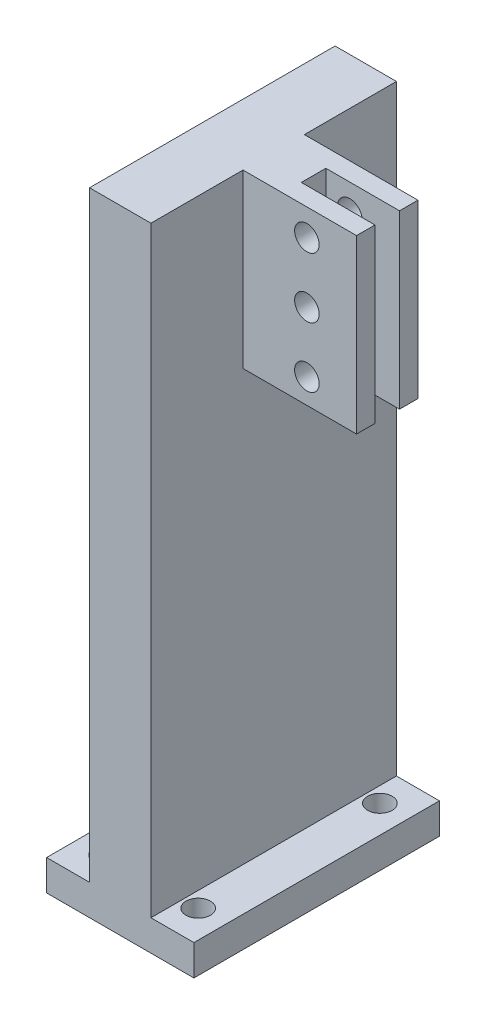
ISO-10303-21;
HEADER;
FILE_DESCRIPTION(('STEP AP214'),'2;1');
FILE_NAME('part.step','',(''),(''),'','','');
FILE_SCHEMA(('AUTOMOTIVE_DESIGN { 1 0 10303 214 1 1 1 1 }'));
ENDSEC;
DATA;
#1=APPLICATION_CONTEXT('core data for automotive mechanical design processes');
#2=APPLICATION_PROTOCOL_DEFINITION('international standard','automotive_design',2000,#1);
#3=PRODUCT_CONTEXT('',#1,'mechanical');
#4=PRODUCT('Part','Part','',(#3));
#5=PRODUCT_RELATED_PRODUCT_CATEGORY('part','',(#4));
#6=PRODUCT_DEFINITION_FORMATION('','',#4);
#7=PRODUCT_DEFINITION_CONTEXT('part definition',#1,'design');
#8=PRODUCT_DEFINITION('design','',#6,#7);
#9=PRODUCT_DEFINITION_SHAPE('','',#8);
#10=(LENGTH_UNIT() NAMED_UNIT(*) SI_UNIT(.MILLI.,.METRE.));
#11=(NAMED_UNIT(*) PLANE_ANGLE_UNIT() SI_UNIT($,.RADIAN.));
#12=(NAMED_UNIT(*) SI_UNIT($,.STERADIAN.) SOLID_ANGLE_UNIT());
#13=UNCERTAINTY_MEASURE_WITH_UNIT(LENGTH_MEASURE(1.E-05),#10,'distance_accuracy_value','');
#14=(GEOMETRIC_REPRESENTATION_CONTEXT(3) GLOBAL_UNCERTAINTY_ASSIGNED_CONTEXT((#13)) GLOBAL_UNIT_ASSIGNED_CONTEXT((#10,
#11,#12)) REPRESENTATION_CONTEXT('',''));
#15=CARTESIAN_POINT('',(0.,0.,0.));
#16=DIRECTION('',(0.,0.,1.));
#17=DIRECTION('',(1.,0.,0.));
#18=AXIS2_PLACEMENT_3D('',#15,#16,#17);
#19=CARTESIAN_POINT('',(0.,103.,0.));
#20=DIRECTION('',(0.,1.,0.));
#21=DIRECTION('',(0.,0.,1.));
#22=AXIS2_PLACEMENT_3D('',#19,#20,#21);
#23=PLANE('',#22);
#24=DIRECTION('',(0.,0.,1.));
#25=VECTOR('',#24,1.);
#26=CARTESIAN_POINT('',(11.5,103.,-2.));
#27=LINE('',#26,#25);
#28=CARTESIAN_POINT('',(11.5,103.,-2.));
#29=VERTEX_POINT('',#28);
#30=CARTESIAN_POINT('',(11.5,103.,2.));
#31=VERTEX_POINT('',#30);
#32=EDGE_CURVE('E176',#29,#31,#27,.T.);
#33=ORIENTED_EDGE('',*,*,#32,.F.);
#34=DIRECTION('',(-1.,0.,0.));
#35=VECTOR('',#34,1.);
#36=CARTESIAN_POINT('',(23.5,103.,-2.));
#37=LINE('',#36,#35);
#38=CARTESIAN_POINT('',(23.5,103.,-2.));
#39=VERTEX_POINT('',#38);
#40=EDGE_CURVE('E163',#39,#29,#37,.T.);
#41=ORIENTED_EDGE('',*,*,#40,.F.);
#42=DIRECTION('',(0.,0.,1.));
#43=VECTOR('',#42,1.);
#44=CARTESIAN_POINT('',(23.5,103.,5.));
#45=LINE('',#44,#43);
#46=CARTESIAN_POINT('',(23.5,103.,-5.));
#47=VERTEX_POINT('',#46);
#48=EDGE_CURVE('E174',#47,#39,#45,.T.);
#49=ORIENTED_EDGE('',*,*,#48,.F.);
#50=DIRECTION('',(-1.,0.,0.));
#51=VECTOR('',#50,1.);
#52=CARTESIAN_POINT('',(23.5,103.,-5.));
#53=LINE('',#52,#51);
#54=CARTESIAN_POINT('',(5.,103.,-5.));
#55=VERTEX_POINT('',#54);
#56=EDGE_CURVE('E217',#47,#55,#53,.T.);
#57=ORIENTED_EDGE('',*,*,#56,.T.);
#58=DIRECTION('',(0.,0.,-1.));
#59=VECTOR('',#58,1.);
#60=CARTESIAN_POINT('',(5.,103.,20.));
#61=LINE('',#60,#59);
#62=CARTESIAN_POINT('',(5.,103.,-20.));
#63=VERTEX_POINT('',#62);
#64=EDGE_CURVE('E225',#55,#63,#61,.T.);
#65=ORIENTED_EDGE('',*,*,#64,.T.);
#66=DIRECTION('',(-1.,0.,0.));
#67=VECTOR('',#66,1.);
#68=CARTESIAN_POINT('',(5.,103.,-20.));
#69=LINE('',#68,#67);
#70=CARTESIAN_POINT('',(-5.,103.,-20.));
#71=VERTEX_POINT('',#70);
#72=EDGE_CURVE('E231',#63,#71,#69,.T.);
#73=ORIENTED_EDGE('',*,*,#72,.T.);
#74=DIRECTION('',(0.,0.,1.));
#75=VECTOR('',#74,1.);
#76=CARTESIAN_POINT('',(-5.,103.,-20.));
#77=LINE('',#76,#75);
#78=CARTESIAN_POINT('',(-5.,103.,20.));
#79=VERTEX_POINT('',#78);
#80=EDGE_CURVE('E234',#71,#79,#77,.T.);
#81=ORIENTED_EDGE('',*,*,#80,.T.);
#82=DIRECTION('',(1.,0.,0.));
#83=VECTOR('',#82,1.);
#84=CARTESIAN_POINT('',(-5.,103.,20.));
#85=LINE('',#84,#83);
#86=CARTESIAN_POINT('',(5.,103.,20.));
#87=VERTEX_POINT('',#86);
#88=EDGE_CURVE('E221',#79,#87,#85,.T.);
#89=ORIENTED_EDGE('',*,*,#88,.T.);
#90=CARTESIAN_POINT('',(5.,103.,5.));
#91=VERTEX_POINT('',#90);
#92=EDGE_CURVE('E227',#87,#91,#61,.T.);
#93=ORIENTED_EDGE('',*,*,#92,.T.);
#94=DIRECTION('',(-1.,0.,0.));
#95=VECTOR('',#94,1.);
#96=CARTESIAN_POINT('',(23.5,103.,5.));
#97=LINE('',#96,#95);
#98=CARTESIAN_POINT('',(23.5,103.,5.));
#99=VERTEX_POINT('',#98);
#100=EDGE_CURVE('E214',#99,#91,#97,.T.);
#101=ORIENTED_EDGE('',*,*,#100,.F.);
#102=CARTESIAN_POINT('',(23.5,103.,2.));
#103=VERTEX_POINT('',#102);
#104=EDGE_CURVE('E185',#103,#99,#45,.T.);
#105=ORIENTED_EDGE('',*,*,#104,.F.);
#106=DIRECTION('',(-1.,0.,0.));
#107=VECTOR('',#106,1.);
#108=CARTESIAN_POINT('',(23.5,103.,2.));
#109=LINE('',#108,#107);
#110=EDGE_CURVE('E57',#103,#31,#109,.T.);
#111=ORIENTED_EDGE('',*,*,#110,.T.);
#112=EDGE_LOOP('',(#33,#41,#49,#57,#65,#73,#81,#89,#93,#101,#105,#111));
#113=FACE_BOUND('',#112,.T.);
#114=ADVANCED_FACE('F39',(#113),#23,.T.);
#115=CARTESIAN_POINT('',(23.5,75.,-5.));
#116=DIRECTION('',(0.,1.,0.));
#117=DIRECTION('',(0.,0.,1.));
#118=AXIS2_PLACEMENT_3D('',#115,#116,#117);
#119=PLANE('',#118);
#120=DIRECTION('',(1.,0.,0.));
#121=VECTOR('',#120,1.);
#122=CARTESIAN_POINT('',(11.5,75.,-2.));
#123=LINE('',#122,#121);
#124=CARTESIAN_POINT('',(11.5,75.,-2.));
#125=VERTEX_POINT('',#124);
#126=CARTESIAN_POINT('',(23.5,75.,-2.));
#127=VERTEX_POINT('',#126);
#128=EDGE_CURVE('E166',#125,#127,#123,.T.);
#129=ORIENTED_EDGE('',*,*,#128,.F.);
#130=DIRECTION('',(0.,0.,1.));
#131=VECTOR('',#130,1.);
#132=CARTESIAN_POINT('',(11.5,75.,-2.));
#133=LINE('',#132,#131);
#134=CARTESIAN_POINT('',(11.5,75.,2.));
#135=VERTEX_POINT('',#134);
#136=EDGE_CURVE('E345',#125,#135,#133,.T.);
#137=ORIENTED_EDGE('',*,*,#136,.T.);
#138=DIRECTION('',(1.,0.,0.));
#139=VECTOR('',#138,1.);
#140=CARTESIAN_POINT('',(11.5,75.,2.));
#141=LINE('',#140,#139);
#142=CARTESIAN_POINT('',(23.5,75.,2.));
#143=VERTEX_POINT('',#142);
#144=EDGE_CURVE('E171',#135,#143,#141,.T.);
#145=ORIENTED_EDGE('',*,*,#144,.T.);
#146=DIRECTION('',(0.,0.,-1.));
#147=VECTOR('',#146,1.);
#148=CARTESIAN_POINT('',(23.5,75.,-5.));
#149=LINE('',#148,#147);
#150=CARTESIAN_POINT('',(23.5,75.,5.));
#151=VERTEX_POINT('',#150);
#152=EDGE_CURVE('E194',#151,#143,#149,.T.);
#153=ORIENTED_EDGE('',*,*,#152,.F.);
#154=DIRECTION('',(-1.,0.,0.));
#155=VECTOR('',#154,1.);
#156=CARTESIAN_POINT('',(23.5,75.,5.));
#157=LINE('',#156,#155);
#158=CARTESIAN_POINT('',(5.,75.,5.));
#159=VERTEX_POINT('',#158);
#160=EDGE_CURVE('E210',#151,#159,#157,.T.);
#161=ORIENTED_EDGE('',*,*,#160,.T.);
#162=DIRECTION('',(0.,0.,-1.));
#163=VECTOR('',#162,1.);
#164=CARTESIAN_POINT('',(5.,75.,-5.));
#165=LINE('',#164,#163);
#166=CARTESIAN_POINT('',(5.,75.,-5.));
#167=VERTEX_POINT('',#166);
#168=EDGE_CURVE('E205',#159,#167,#165,.T.);
#169=ORIENTED_EDGE('',*,*,#168,.T.);
#170=DIRECTION('',(-1.,0.,0.));
#171=VECTOR('',#170,1.);
#172=CARTESIAN_POINT('',(23.5,75.,-5.));
#173=LINE('',#172,#171);
#174=CARTESIAN_POINT('',(23.5,75.,-5.));
#175=VERTEX_POINT('',#174);
#176=EDGE_CURVE('E198',#175,#167,#173,.T.);
#177=ORIENTED_EDGE('',*,*,#176,.F.);
#178=EDGE_CURVE('E189',#127,#175,#149,.T.);
#179=ORIENTED_EDGE('',*,*,#178,.F.);
#180=EDGE_LOOP('',(#129,#137,#145,#153,#161,#169,#177,#179));
#181=FACE_BOUND('',#180,.T.);
#182=ADVANCED_FACE('F407',(#181),#119,.F.);
#183=CARTESIAN_POINT('',(23.5,0.,0.));
#184=DIRECTION('',(-1.,0.,0.));
#185=DIRECTION('',(0.,0.,1.));
#186=AXIS2_PLACEMENT_3D('',#183,#184,#185);
#187=PLANE('',#186);
#188=DIRECTION('',(0.,1.,0.));
#189=VECTOR('',#188,1.);
#190=CARTESIAN_POINT('',(23.5,75.,-2.));
#191=LINE('',#190,#189);
#192=EDGE_CURVE('E158',#127,#39,#191,.T.);
#193=ORIENTED_EDGE('',*,*,#192,.F.);
#194=ORIENTED_EDGE('',*,*,#178,.T.);
#195=DIRECTION('',(0.,1.,0.));
#196=VECTOR('',#195,1.);
#197=CARTESIAN_POINT('',(23.5,103.,-5.));
#198=LINE('',#197,#196);
#199=EDGE_CURVE('E182',#175,#47,#198,.T.);
#200=ORIENTED_EDGE('',*,*,#199,.T.);
#201=ORIENTED_EDGE('',*,*,#48,.T.);
#202=EDGE_LOOP('',(#193,#194,#200,#201));
#203=FACE_BOUND('',#202,.T.);
#204=ADVANCED_FACE('F180',(#203),#187,.F.);
#205=CARTESIAN_POINT('',(15.41,79.03,19.5));
#206=DIRECTION('',(0.,0.,-1.));
#207=DIRECTION('',(0.,1.,0.));
#208=AXIS2_PLACEMENT_3D('',#205,#206,#207);
#209=CYLINDRICAL_SURFACE('',#208,2.);
#210=CARTESIAN_POINT('',(15.41,79.03,-5.));
#211=DIRECTION('',(0.,0.,-1.));
#212=DIRECTION('',(0.,1.,0.));
#213=AXIS2_PLACEMENT_3D('',#210,#211,#212);
#214=CIRCLE('',#213,2.);
#215=CARTESIAN_POINT('',(15.41,81.03,-5.));
#216=VERTEX_POINT('',#215);
#217=EDGE_CURVE('E373',#216,#216,#214,.T.);
#218=ORIENTED_EDGE('',*,*,#217,.T.);
#219=EDGE_LOOP('',(#218));
#220=FACE_BOUND('',#219,.T.);
#221=CARTESIAN_POINT('',(15.41,79.03,-2.));
#222=DIRECTION('',(0.,0.,1.));
#223=DIRECTION('',(1.,0.,0.));
#224=AXIS2_PLACEMENT_3D('',#221,#222,#223);
#225=CIRCLE('',#224,2.);
#226=CARTESIAN_POINT('',(17.41,79.03,-2.));
#227=VERTEX_POINT('',#226);
#228=EDGE_CURVE('E369',#227,#227,#225,.F.);
#229=ORIENTED_EDGE('',*,*,#228,.F.);
#230=EDGE_LOOP('',(#229));
#231=FACE_BOUND('',#230,.T.);
#232=ADVANCED_FACE('F384',(#220,#231),#209,.F.);
#233=CARTESIAN_POINT('',(15.41,88.85,19.5));
#234=DIRECTION('',(0.,0.,-1.));
#235=DIRECTION('',(0.,1.,0.));
#236=AXIS2_PLACEMENT_3D('',#233,#234,#235);
#237=CYLINDRICAL_SURFACE('',#236,2.);
#238=CARTESIAN_POINT('',(15.41,88.85,-5.));
#239=DIRECTION('',(0.,0.,-1.));
#240=DIRECTION('',(0.,1.,0.));
#241=AXIS2_PLACEMENT_3D('',#238,#239,#240);
#242=CIRCLE('',#241,2.);
#243=CARTESIAN_POINT('',(15.41,90.85,-5.));
#244=VERTEX_POINT('',#243);
#245=EDGE_CURVE('E377',#244,#244,#242,.T.);
#246=ORIENTED_EDGE('',*,*,#245,.T.);
#247=EDGE_LOOP('',(#246));
#248=FACE_BOUND('',#247,.T.);
#249=CARTESIAN_POINT('',(15.41,88.85,-2.));
#250=DIRECTION('',(0.,0.,1.));
#251=DIRECTION('',(1.,0.,0.));
#252=AXIS2_PLACEMENT_3D('',#249,#250,#251);
#253=CIRCLE('',#252,2.);
#254=CARTESIAN_POINT('',(17.41,88.85,-2.));
#255=VERTEX_POINT('',#254);
#256=EDGE_CURVE('E365',#255,#255,#253,.F.);
#257=ORIENTED_EDGE('',*,*,#256,.F.);
#258=EDGE_LOOP('',(#257));
#259=FACE_BOUND('',#258,.T.);
#260=ADVANCED_FACE('F528',(#248,#259),#237,.F.);
#261=CARTESIAN_POINT('',(15.41,98.67,19.5));
#262=DIRECTION('',(0.,0.,-1.));
#263=DIRECTION('',(0.,1.,0.));
#264=AXIS2_PLACEMENT_3D('',#261,#262,#263);
#265=CYLINDRICAL_SURFACE('',#264,2.);
#266=CARTESIAN_POINT('',(15.41,98.67,-5.));
#267=DIRECTION('',(0.,0.,-1.));
#268=DIRECTION('',(0.,1.,0.));
#269=AXIS2_PLACEMENT_3D('',#266,#267,#268);
#270=CIRCLE('',#269,2.);
#271=CARTESIAN_POINT('',(15.41,100.67,-5.));
#272=VERTEX_POINT('',#271);
#273=EDGE_CURVE('E335',#272,#272,#270,.T.);
#274=ORIENTED_EDGE('',*,*,#273,.T.);
#275=EDGE_LOOP('',(#274));
#276=FACE_BOUND('',#275,.T.);
#277=CARTESIAN_POINT('',(15.41,98.67,-2.));
#278=DIRECTION('',(0.,0.,1.));
#279=DIRECTION('',(1.,0.,0.));
#280=AXIS2_PLACEMENT_3D('',#277,#278,#279);
#281=CIRCLE('',#280,2.);
#282=CARTESIAN_POINT('',(17.41,98.67,-2.));
#283=VERTEX_POINT('',#282);
#284=EDGE_CURVE('E43',#283,#283,#281,.F.);
#285=ORIENTED_EDGE('',*,*,#284,.F.);
#286=EDGE_LOOP('',(#285));
#287=FACE_BOUND('',#286,.T.);
#288=ADVANCED_FACE('F417',(#276,#287),#265,.F.);
#289=CARTESIAN_POINT('',(5.,103.,20.));
#290=DIRECTION('',(-1.,0.,0.));
#291=DIRECTION('',(0.,0.,1.));
#292=AXIS2_PLACEMENT_3D('',#289,#290,#291);
#293=PLANE('',#292);
#294=DIRECTION('',(0.,1.,0.));
#295=VECTOR('',#294,1.);
#296=CARTESIAN_POINT('',(5.,103.,-5.));
#297=LINE('',#296,#295);
#298=EDGE_CURVE('E65',#167,#55,#297,.T.);
#299=ORIENTED_EDGE('',*,*,#298,.F.);
#300=ORIENTED_EDGE('',*,*,#168,.F.);
#301=DIRECTION('',(0.,-1.,0.));
#302=VECTOR('',#301,1.);
#303=CARTESIAN_POINT('',(5.,75.,5.));
#304=LINE('',#303,#302);
#305=EDGE_CURVE('E201',#91,#159,#304,.T.);
#306=ORIENTED_EDGE('',*,*,#305,.F.);
#307=ORIENTED_EDGE('',*,*,#92,.F.);
#308=DIRECTION('',(0.,-1.,0.));
#309=VECTOR('',#308,1.);
#310=CARTESIAN_POINT('',(5.,103.,20.));
#311=LINE('',#310,#309);
#312=CARTESIAN_POINT('',(5.,5.,20.));
#313=VERTEX_POINT('',#312);
#314=EDGE_CURVE('E255',#87,#313,#311,.T.);
#315=ORIENTED_EDGE('',*,*,#314,.T.);
#316=DIRECTION('',(0.,0.,-1.));
#317=VECTOR('',#316,1.);
#318=CARTESIAN_POINT('',(5.,5.,20.));
#319=LINE('',#318,#317);
#320=CARTESIAN_POINT('',(5.,5.,-20.));
#321=VERTEX_POINT('',#320);
#322=EDGE_CURVE('E220',#313,#321,#319,.T.);
#323=ORIENTED_EDGE('',*,*,#322,.T.);
#324=DIRECTION('',(0.,-1.,0.));
#325=VECTOR('',#324,1.);
#326=CARTESIAN_POINT('',(5.,103.,-20.));
#327=LINE('',#326,#325);
#328=EDGE_CURVE('E251',#63,#321,#327,.T.);
#329=ORIENTED_EDGE('',*,*,#328,.F.);
#330=ORIENTED_EDGE('',*,*,#64,.F.);
#331=EDGE_LOOP('',(#299,#300,#306,#307,#315,#323,#329,#330));
#332=FACE_BOUND('',#331,.T.);
#333=ADVANCED_FACE('F413',(#332),#293,.F.);
#334=CARTESIAN_POINT('',(0.,5.,0.));
#335=DIRECTION('',(0.,1.,0.));
#336=DIRECTION('',(0.,0.,1.));
#337=AXIS2_PLACEMENT_3D('',#334,#335,#336);
#338=PLANE('',#337);
#339=DIRECTION('',(0.,0.,1.));
#340=VECTOR('',#339,1.);
#341=CARTESIAN_POINT('',(-5.,5.,0.));
#342=LINE('',#341,#340);
#343=CARTESIAN_POINT('',(-4.99999999999999,5.,-20.));
#344=VERTEX_POINT('',#343);
#345=CARTESIAN_POINT('',(-5.,5.,20.));
#346=VERTEX_POINT('',#345);
#347=EDGE_CURVE('E226',#344,#346,#342,.T.);
#348=ORIENTED_EDGE('',*,*,#347,.F.);
#349=DIRECTION('',(-1.,0.,0.));
#350=VECTOR('',#349,1.);
#351=CARTESIAN_POINT('',(12.,5.,-20.));
#352=LINE('',#351,#350);
#353=CARTESIAN_POINT('',(-12.,5.,-20.));
#354=VERTEX_POINT('',#353);
#355=EDGE_CURVE('E296',#344,#354,#352,.T.);
#356=ORIENTED_EDGE('',*,*,#355,.T.);
#357=DIRECTION('',(0.,0.,1.));
#358=VECTOR('',#357,1.);
#359=CARTESIAN_POINT('',(-12.,5.,20.));
#360=LINE('',#359,#358);
#361=CARTESIAN_POINT('',(-12.,5.,20.));
#362=VERTEX_POINT('',#361);
#363=EDGE_CURVE('E301',#354,#362,#360,.T.);
#364=ORIENTED_EDGE('',*,*,#363,.T.);
#365=DIRECTION('',(1.,0.,0.));
#366=VECTOR('',#365,1.);
#367=CARTESIAN_POINT('',(12.,5.,20.));
#368=LINE('',#367,#366);
#369=EDGE_CURVE('E305',#362,#346,#368,.T.);
#370=ORIENTED_EDGE('',*,*,#369,.T.);
#371=EDGE_LOOP('',(#348,#356,#364,#370));
#372=FACE_BOUND('',#371,.T.);
#373=CARTESIAN_POINT('',(-7.5,5.,14.8));
#374=DIRECTION('',(0.,1.,0.));
#375=DIRECTION('',(0.,0.,1.));
#376=AXIS2_PLACEMENT_3D('',#373,#374,#375);
#377=CIRCLE('',#376,2.);
#378=CARTESIAN_POINT('',(-7.5,5.,16.8));
#379=VERTEX_POINT('',#378);
#380=EDGE_CURVE('E276',#379,#379,#377,.T.);
#381=ORIENTED_EDGE('',*,*,#380,.F.);
#382=EDGE_LOOP('',(#381));
#383=FACE_BOUND('',#382,.T.);
#384=CARTESIAN_POINT('',(-7.5,5.,-14.8));
#385=DIRECTION('',(0.,1.,0.));
#386=DIRECTION('',(0.,0.,-1.));
#387=AXIS2_PLACEMENT_3D('',#384,#385,#386);
#388=CIRCLE('',#387,2.);
#389=CARTESIAN_POINT('',(-7.5,5.,-16.8));
#390=VERTEX_POINT('',#389);
#391=EDGE_CURVE('E268',#390,#390,#388,.T.);
#392=ORIENTED_EDGE('',*,*,#391,.F.);
#393=EDGE_LOOP('',(#392));
#394=FACE_BOUND('',#393,.T.);
#395=ADVANCED_FACE('F416',(#372,#383,#394),#338,.T.);
#396=ORIENTED_EDGE('',*,*,#322,.F.);
#397=CARTESIAN_POINT('',(12.,5.,20.));
#398=VERTEX_POINT('',#397);
#399=EDGE_CURVE('E304',#313,#398,#368,.T.);
#400=ORIENTED_EDGE('',*,*,#399,.T.);
#401=DIRECTION('',(0.,0.,-1.));
#402=VECTOR('',#401,1.);
#403=CARTESIAN_POINT('',(12.,5.,20.));
#404=LINE('',#403,#402);
#405=CARTESIAN_POINT('',(12.,5.,-20.));
#406=VERTEX_POINT('',#405);
#407=EDGE_CURVE('E292',#398,#406,#404,.T.);
#408=ORIENTED_EDGE('',*,*,#407,.T.);
#409=EDGE_CURVE('E298',#406,#321,#352,.T.);
#410=ORIENTED_EDGE('',*,*,#409,.T.);
#411=EDGE_LOOP('',(#396,#400,#408,#410));
#412=FACE_BOUND('',#411,.T.);
#413=CARTESIAN_POINT('',(7.5,5.,14.8));
#414=DIRECTION('',(0.,1.,0.));
#415=DIRECTION('',(0.,0.,1.));
#416=AXIS2_PLACEMENT_3D('',#413,#414,#415);
#417=CIRCLE('',#416,2.);
#418=CARTESIAN_POINT('',(7.5,5.,16.8));
#419=VERTEX_POINT('',#418);
#420=EDGE_CURVE('E284',#419,#419,#417,.T.);
#421=ORIENTED_EDGE('',*,*,#420,.F.);
#422=EDGE_LOOP('',(#421));
#423=FACE_BOUND('',#422,.T.);
#424=CARTESIAN_POINT('',(7.5,5.,-14.8));
#425=DIRECTION('',(0.,1.,0.));
#426=DIRECTION('',(0.,0.,-1.));
#427=AXIS2_PLACEMENT_3D('',#424,#425,#426);
#428=CIRCLE('',#427,2.);
#429=CARTESIAN_POINT('',(7.5,5.,-16.8));
#430=VERTEX_POINT('',#429);
#431=EDGE_CURVE('E260',#430,#430,#428,.T.);
#432=ORIENTED_EDGE('',*,*,#431,.F.);
#433=EDGE_LOOP('',(#432));
#434=FACE_BOUND('',#433,.T.);
#435=ADVANCED_FACE('F435',(#412,#423,#434),#338,.T.);
#436=CARTESIAN_POINT('',(0.,0.,0.));
#437=DIRECTION('',(0.,1.,0.));
#438=DIRECTION('',(0.,0.,1.));
#439=AXIS2_PLACEMENT_3D('',#436,#437,#438);
#440=PLANE('',#439);
#441=DIRECTION('',(0.,0.,-1.));
#442=VECTOR('',#441,1.);
#443=CARTESIAN_POINT('',(12.,0.,20.));
#444=LINE('',#443,#442);
#445=CARTESIAN_POINT('',(12.,0.,20.));
#446=VERTEX_POINT('',#445);
#447=CARTESIAN_POINT('',(12.,0.,-20.));
#448=VERTEX_POINT('',#447);
#449=EDGE_CURVE('E288',#446,#448,#444,.T.);
#450=ORIENTED_EDGE('',*,*,#449,.F.);
#451=DIRECTION('',(1.,0.,0.));
#452=VECTOR('',#451,1.);
#453=CARTESIAN_POINT('',(12.,0.,20.));
#454=LINE('',#453,#452);
#455=CARTESIAN_POINT('',(-12.,0.,20.));
#456=VERTEX_POINT('',#455);
#457=EDGE_CURVE('E297',#456,#446,#454,.T.);
#458=ORIENTED_EDGE('',*,*,#457,.F.);
#459=DIRECTION('',(0.,0.,1.));
#460=VECTOR('',#459,1.);
#461=CARTESIAN_POINT('',(-12.,0.,20.));
#462=LINE('',#461,#460);
#463=CARTESIAN_POINT('',(-12.,0.,-20.));
#464=VERTEX_POINT('',#463);
#465=EDGE_CURVE('E315',#464,#456,#462,.T.);
#466=ORIENTED_EDGE('',*,*,#465,.F.);
#467=DIRECTION('',(-1.,0.,0.));
#468=VECTOR('',#467,1.);
#469=CARTESIAN_POINT('',(12.,0.,-20.));
#470=LINE('',#469,#468);
#471=EDGE_CURVE('E312',#448,#464,#470,.T.);
#472=ORIENTED_EDGE('',*,*,#471,.F.);
#473=EDGE_LOOP('',(#450,#458,#466,#472));
#474=FACE_BOUND('',#473,.T.);
#475=CARTESIAN_POINT('',(7.5,0.,14.8));
#476=DIRECTION('',(0.,1.,0.));
#477=DIRECTION('',(0.,0.,1.));
#478=AXIS2_PLACEMENT_3D('',#475,#476,#477);
#479=CIRCLE('',#478,2.);
#480=CARTESIAN_POINT('',(7.5,0.,16.8));
#481=VERTEX_POINT('',#480);
#482=EDGE_CURVE('E280',#481,#481,#479,.T.);
#483=ORIENTED_EDGE('',*,*,#482,.T.);
#484=EDGE_LOOP('',(#483));
#485=FACE_BOUND('',#484,.T.);
#486=CARTESIAN_POINT('',(-7.5,0.,14.8));
#487=DIRECTION('',(0.,1.,0.));
#488=DIRECTION('',(0.,0.,1.));
#489=AXIS2_PLACEMENT_3D('',#486,#487,#488);
#490=CIRCLE('',#489,2.);
#491=CARTESIAN_POINT('',(-7.5,0.,16.8));
#492=VERTEX_POINT('',#491);
#493=EDGE_CURVE('E272',#492,#492,#490,.T.);
#494=ORIENTED_EDGE('',*,*,#493,.T.);
#495=EDGE_LOOP('',(#494));
#496=FACE_BOUND('',#495,.T.);
#497=CARTESIAN_POINT('',(-7.5,0.,-14.8));
#498=DIRECTION('',(0.,1.,0.));
#499=DIRECTION('',(0.,0.,-1.));
#500=AXIS2_PLACEMENT_3D('',#497,#498,#499);
#501=CIRCLE('',#500,2.);
#502=CARTESIAN_POINT('',(-7.5,0.,-16.8));
#503=VERTEX_POINT('',#502);
#504=EDGE_CURVE('E264',#503,#503,#501,.T.);
#505=ORIENTED_EDGE('',*,*,#504,.T.);
#506=EDGE_LOOP('',(#505));
#507=FACE_BOUND('',#506,.T.);
#508=CARTESIAN_POINT('',(7.5,0.,-14.8));
#509=DIRECTION('',(0.,1.,0.));
#510=DIRECTION('',(0.,0.,-1.));
#511=AXIS2_PLACEMENT_3D('',#508,#509,#510);
#512=CIRCLE('',#511,2.);
#513=CARTESIAN_POINT('',(7.5,0.,-16.8));
#514=VERTEX_POINT('',#513);
#515=EDGE_CURVE('E259',#514,#514,#512,.T.);
#516=ORIENTED_EDGE('',*,*,#515,.T.);
#517=EDGE_LOOP('',(#516));
#518=FACE_BOUND('',#517,.T.);
#519=ADVANCED_FACE('F438',(#474,#485,#496,#507,#518),#440,.F.);
#520=CARTESIAN_POINT('',(12.,5.,20.));
#521=DIRECTION('',(-1.,0.,0.));
#522=DIRECTION('',(0.,0.,1.));
#523=AXIS2_PLACEMENT_3D('',#520,#521,#522);
#524=PLANE('',#523);
#525=ORIENTED_EDGE('',*,*,#449,.T.);
#526=DIRECTION('',(0.,-1.,0.));
#527=VECTOR('',#526,1.);
#528=CARTESIAN_POINT('',(12.,5.,-20.));
#529=LINE('',#528,#527);
#530=EDGE_CURVE('E11',#406,#448,#529,.T.);
#531=ORIENTED_EDGE('',*,*,#530,.F.);
#532=ORIENTED_EDGE('',*,*,#407,.F.);
#533=DIRECTION('',(0.,-1.,0.));
#534=VECTOR('',#533,1.);
#535=CARTESIAN_POINT('',(12.,5.,20.));
#536=LINE('',#535,#534);
#537=EDGE_CURVE('E308',#398,#446,#536,.T.);
#538=ORIENTED_EDGE('',*,*,#537,.T.);
#539=EDGE_LOOP('',(#525,#531,#532,#538));
#540=FACE_BOUND('',#539,.T.);
#541=ADVANCED_FACE('F41',(#540),#524,.F.);
#542=CARTESIAN_POINT('',(12.,5.,-20.));
#543=DIRECTION('',(0.,0.,1.));
#544=DIRECTION('',(1.,0.,0.));
#545=AXIS2_PLACEMENT_3D('',#542,#543,#544);
#546=PLANE('',#545);
#547=ORIENTED_EDGE('',*,*,#471,.T.);
#548=DIRECTION('',(0.,-1.,0.));
#549=VECTOR('',#548,1.);
#550=CARTESIAN_POINT('',(-12.,5.,-20.));
#551=LINE('',#550,#549);
#552=EDGE_CURVE('E49',#354,#464,#551,.T.);
#553=ORIENTED_EDGE('',*,*,#552,.F.);
#554=ORIENTED_EDGE('',*,*,#355,.F.);
#555=DIRECTION('',(0.,-1.,0.));
#556=VECTOR('',#555,1.);
#557=CARTESIAN_POINT('',(-5.,103.,-20.));
#558=LINE('',#557,#556);
#559=EDGE_CURVE('E247',#71,#344,#558,.T.);
#560=ORIENTED_EDGE('',*,*,#559,.F.);
#561=ORIENTED_EDGE('',*,*,#72,.F.);
#562=ORIENTED_EDGE('',*,*,#328,.T.);
#563=ORIENTED_EDGE('',*,*,#409,.F.);
#564=ORIENTED_EDGE('',*,*,#530,.T.);
#565=EDGE_LOOP('',(#547,#553,#554,#560,#561,#562,#563,#564));
#566=FACE_BOUND('',#565,.T.);
#567=ADVANCED_FACE('F448',(#566),#546,.F.);
#568=CARTESIAN_POINT('',(-12.,5.,20.));
#569=DIRECTION('',(1.,0.,0.));
#570=DIRECTION('',(0.,0.,-1.));
#571=AXIS2_PLACEMENT_3D('',#568,#569,#570);
#572=PLANE('',#571);
#573=ORIENTED_EDGE('',*,*,#465,.T.);
#574=DIRECTION('',(0.,-1.,0.));
#575=VECTOR('',#574,1.);
#576=CARTESIAN_POINT('',(-12.,5.,20.));
#577=LINE('',#576,#575);
#578=EDGE_CURVE('E323',#362,#456,#577,.T.);
#579=ORIENTED_EDGE('',*,*,#578,.F.);
#580=ORIENTED_EDGE('',*,*,#363,.F.);
#581=ORIENTED_EDGE('',*,*,#552,.T.);
#582=EDGE_LOOP('',(#573,#579,#580,#581));
#583=FACE_BOUND('',#582,.T.);
#584=ADVANCED_FACE('F445',(#583),#572,.F.);
#585=CARTESIAN_POINT('',(12.,5.,20.));
#586=DIRECTION('',(0.,0.,-1.));
#587=DIRECTION('',(-1.,0.,0.));
#588=AXIS2_PLACEMENT_3D('',#585,#586,#587);
#589=PLANE('',#588);
#590=ORIENTED_EDGE('',*,*,#457,.T.);
#591=ORIENTED_EDGE('',*,*,#537,.F.);
#592=ORIENTED_EDGE('',*,*,#399,.F.);
#593=ORIENTED_EDGE('',*,*,#314,.F.);
#594=ORIENTED_EDGE('',*,*,#88,.F.);
#595=DIRECTION('',(0.,-1.,0.));
#596=VECTOR('',#595,1.);
#597=CARTESIAN_POINT('',(-5.,103.,20.));
#598=LINE('',#597,#596);
#599=EDGE_CURVE('E237',#79,#346,#598,.T.);
#600=ORIENTED_EDGE('',*,*,#599,.T.);
#601=ORIENTED_EDGE('',*,*,#369,.F.);
#602=ORIENTED_EDGE('',*,*,#578,.T.);
#603=EDGE_LOOP('',(#590,#591,#592,#593,#594,#600,#601,#602));
#604=FACE_BOUND('',#603,.T.);
#605=ADVANCED_FACE('F433',(#604),#589,.F.);
#606=CARTESIAN_POINT('',(7.5,5.,14.8));
#607=DIRECTION('',(0.,-1.,0.));
#608=DIRECTION('',(0.,0.,-1.));
#609=AXIS2_PLACEMENT_3D('',#606,#607,#608);
#610=CYLINDRICAL_SURFACE('',#609,2.);
#611=ORIENTED_EDGE('',*,*,#420,.T.);
#612=EDGE_LOOP('',(#611));
#613=FACE_BOUND('',#612,.T.);
#614=ORIENTED_EDGE('',*,*,#482,.F.);
#615=EDGE_LOOP('',(#614));
#616=FACE_BOUND('',#615,.T.);
#617=ADVANCED_FACE('F429',(#613,#616),#610,.F.);
#618=CARTESIAN_POINT('',(-7.5,5.,14.8));
#619=DIRECTION('',(0.,-1.,0.));
#620=DIRECTION('',(0.,0.,-1.));
#621=AXIS2_PLACEMENT_3D('',#618,#619,#620);
#622=CYLINDRICAL_SURFACE('',#621,2.);
#623=ORIENTED_EDGE('',*,*,#380,.T.);
#624=EDGE_LOOP('',(#623));
#625=FACE_BOUND('',#624,.T.);
#626=ORIENTED_EDGE('',*,*,#493,.F.);
#627=EDGE_LOOP('',(#626));
#628=FACE_BOUND('',#627,.T.);
#629=ADVANCED_FACE('F425',(#625,#628),#622,.F.);
#630=CARTESIAN_POINT('',(-7.5,5.,-14.8));
#631=DIRECTION('',(0.,-1.,0.));
#632=DIRECTION('',(0.,0.,-1.));
#633=AXIS2_PLACEMENT_3D('',#630,#631,#632);
#634=CYLINDRICAL_SURFACE('',#633,2.);
#635=ORIENTED_EDGE('',*,*,#391,.T.);
#636=EDGE_LOOP('',(#635));
#637=FACE_BOUND('',#636,.T.);
#638=ORIENTED_EDGE('',*,*,#504,.F.);
#639=EDGE_LOOP('',(#638));
#640=FACE_BOUND('',#639,.T.);
#641=ADVANCED_FACE('F421',(#637,#640),#634,.F.);
#642=CARTESIAN_POINT('',(7.5,5.,-14.8));
#643=DIRECTION('',(0.,-1.,0.));
#644=DIRECTION('',(0.,0.,-1.));
#645=AXIS2_PLACEMENT_3D('',#642,#643,#644);
#646=CYLINDRICAL_SURFACE('',#645,2.);
#647=ORIENTED_EDGE('',*,*,#431,.T.);
#648=EDGE_LOOP('',(#647));
#649=FACE_BOUND('',#648,.T.);
#650=ORIENTED_EDGE('',*,*,#515,.F.);
#651=EDGE_LOOP('',(#650));
#652=FACE_BOUND('',#651,.T.);
#653=ADVANCED_FACE('F400',(#649,#652),#646,.F.);
#654=CARTESIAN_POINT('',(-5.,103.,0.));
#655=DIRECTION('',(1.,0.,0.));
#656=DIRECTION('',(0.,0.,-1.));
#657=AXIS2_PLACEMENT_3D('',#654,#655,#656);
#658=PLANE('',#657);
#659=ORIENTED_EDGE('',*,*,#347,.T.);
#660=ORIENTED_EDGE('',*,*,#599,.F.);
#661=ORIENTED_EDGE('',*,*,#80,.F.);
#662=ORIENTED_EDGE('',*,*,#559,.T.);
#663=EDGE_LOOP('',(#659,#660,#661,#662));
#664=FACE_BOUND('',#663,.T.);
#665=ADVANCED_FACE('F390',(#664),#658,.F.);
#666=CARTESIAN_POINT('',(23.5,103.,-5.));
#667=DIRECTION('',(0.,0.,1.));
#668=DIRECTION('',(0.,-1.,0.));
#669=AXIS2_PLACEMENT_3D('',#666,#667,#668);
#670=PLANE('',#669);
#671=ORIENTED_EDGE('',*,*,#273,.F.);
#672=EDGE_LOOP('',(#671));
#673=FACE_BOUND('',#672,.T.);
#674=ORIENTED_EDGE('',*,*,#245,.F.);
#675=EDGE_LOOP('',(#674));
#676=FACE_BOUND('',#675,.T.);
#677=ORIENTED_EDGE('',*,*,#217,.F.);
#678=EDGE_LOOP('',(#677));
#679=FACE_BOUND('',#678,.T.);
#680=ORIENTED_EDGE('',*,*,#298,.T.);
#681=ORIENTED_EDGE('',*,*,#56,.F.);
#682=ORIENTED_EDGE('',*,*,#199,.F.);
#683=ORIENTED_EDGE('',*,*,#176,.T.);
#684=EDGE_LOOP('',(#680,#681,#682,#683));
#685=FACE_BOUND('',#684,.T.);
#686=ADVANCED_FACE('F387',(#673,#676,#679,#685),#670,.F.);
#687=CARTESIAN_POINT('',(23.5,75.,5.));
#688=DIRECTION('',(0.,0.,-1.));
#689=DIRECTION('',(0.,1.,0.));
#690=AXIS2_PLACEMENT_3D('',#687,#688,#689);
#691=PLANE('',#690);
#692=CARTESIAN_POINT('',(15.41,98.67,5.));
#693=DIRECTION('',(0.,0.,-1.));
#694=DIRECTION('',(0.,1.,0.));
#695=AXIS2_PLACEMENT_3D('',#692,#693,#694);
#696=CIRCLE('',#695,2.);
#697=CARTESIAN_POINT('',(15.41,100.67,5.));
#698=VERTEX_POINT('',#697);
#699=EDGE_CURVE('E202',#698,#698,#696,.T.);
#700=ORIENTED_EDGE('',*,*,#699,.T.);
#701=EDGE_LOOP('',(#700));
#702=FACE_BOUND('',#701,.T.);
#703=CARTESIAN_POINT('',(15.41,88.85,5.));
#704=DIRECTION('',(0.,0.,-1.));
#705=DIRECTION('',(0.,1.,0.));
#706=AXIS2_PLACEMENT_3D('',#703,#704,#705);
#707=CIRCLE('',#706,2.);
#708=CARTESIAN_POINT('',(15.41,90.85,5.));
#709=VERTEX_POINT('',#708);
#710=EDGE_CURVE('E334',#709,#709,#707,.T.);
#711=ORIENTED_EDGE('',*,*,#710,.T.);
#712=EDGE_LOOP('',(#711));
#713=FACE_BOUND('',#712,.T.);
#714=CARTESIAN_POINT('',(15.41,79.03,5.));
#715=DIRECTION('',(0.,0.,-1.));
#716=DIRECTION('',(0.,1.,0.));
#717=AXIS2_PLACEMENT_3D('',#714,#715,#716);
#718=CIRCLE('',#717,2.);
#719=CARTESIAN_POINT('',(15.41,81.03,5.));
#720=VERTEX_POINT('',#719);
#721=EDGE_CURVE('E330',#720,#720,#718,.T.);
#722=ORIENTED_EDGE('',*,*,#721,.T.);
#723=EDGE_LOOP('',(#722));
#724=FACE_BOUND('',#723,.T.);
#725=ORIENTED_EDGE('',*,*,#305,.T.);
#726=ORIENTED_EDGE('',*,*,#160,.F.);
#727=DIRECTION('',(0.,-1.,0.));
#728=VECTOR('',#727,1.);
#729=CARTESIAN_POINT('',(23.5,75.,5.));
#730=LINE('',#729,#728);
#731=EDGE_CURVE('E184',#99,#151,#730,.T.);
#732=ORIENTED_EDGE('',*,*,#731,.F.);
#733=ORIENTED_EDGE('',*,*,#100,.T.);
#734=EDGE_LOOP('',(#725,#726,#732,#733));
#735=FACE_BOUND('',#734,.T.);
#736=ADVANCED_FACE('F389',(#702,#713,#724,#735),#691,.F.);
#737=ORIENTED_EDGE('',*,*,#152,.T.);
#738=DIRECTION('',(0.,1.,0.));
#739=VECTOR('',#738,1.);
#740=CARTESIAN_POINT('',(23.5,75.,2.));
#741=LINE('',#740,#739);
#742=EDGE_CURVE('E493',#143,#103,#741,.T.);
#743=ORIENTED_EDGE('',*,*,#742,.T.);
#744=ORIENTED_EDGE('',*,*,#104,.T.);
#745=ORIENTED_EDGE('',*,*,#731,.T.);
#746=EDGE_LOOP('',(#737,#743,#744,#745));
#747=FACE_BOUND('',#746,.T.);
#748=ADVANCED_FACE('F397',(#747),#187,.F.);
#749=CARTESIAN_POINT('',(15.41,79.03,2.));
#750=DIRECTION('',(0.,0.,1.));
#751=DIRECTION('',(1.,0.,0.));
#752=AXIS2_PLACEMENT_3D('',#749,#750,#751);
#753=CIRCLE('',#752,2.);
#754=CARTESIAN_POINT('',(17.41,79.03,2.));
#755=VERTEX_POINT('',#754);
#756=EDGE_CURVE('E351',#755,#755,#753,.F.);
#757=ORIENTED_EDGE('',*,*,#756,.T.);
#758=EDGE_LOOP('',(#757));
#759=FACE_BOUND('',#758,.T.);
#760=ORIENTED_EDGE('',*,*,#721,.F.);
#761=EDGE_LOOP('',(#760));
#762=FACE_BOUND('',#761,.T.);
#763=ADVANCED_FACE('F514',(#759,#762),#209,.F.);
#764=CARTESIAN_POINT('',(15.41,88.85,2.));
#765=DIRECTION('',(0.,0.,1.));
#766=DIRECTION('',(1.,0.,0.));
#767=AXIS2_PLACEMENT_3D('',#764,#765,#766);
#768=CIRCLE('',#767,2.);
#769=CARTESIAN_POINT('',(17.41,88.85,2.));
#770=VERTEX_POINT('',#769);
#771=EDGE_CURVE('E344',#770,#770,#768,.F.);
#772=ORIENTED_EDGE('',*,*,#771,.T.);
#773=EDGE_LOOP('',(#772));
#774=FACE_BOUND('',#773,.T.);
#775=ORIENTED_EDGE('',*,*,#710,.F.);
#776=EDGE_LOOP('',(#775));
#777=FACE_BOUND('',#776,.T.);
#778=ADVANCED_FACE('F517',(#774,#777),#237,.F.);
#779=CARTESIAN_POINT('',(15.41,98.67,2.));
#780=DIRECTION('',(0.,0.,1.));
#781=DIRECTION('',(1.,0.,0.));
#782=AXIS2_PLACEMENT_3D('',#779,#780,#781);
#783=CIRCLE('',#782,2.);
#784=CARTESIAN_POINT('',(17.41,98.67,2.));
#785=VERTEX_POINT('',#784);
#786=EDGE_CURVE('E341',#785,#785,#783,.F.);
#787=ORIENTED_EDGE('',*,*,#786,.T.);
#788=EDGE_LOOP('',(#787));
#789=FACE_BOUND('',#788,.T.);
#790=ORIENTED_EDGE('',*,*,#699,.F.);
#791=EDGE_LOOP('',(#790));
#792=FACE_BOUND('',#791,.T.);
#793=ADVANCED_FACE('F525',(#789,#792),#265,.F.);
#794=CARTESIAN_POINT('',(0.,0.,-2.));
#795=DIRECTION('',(0.,0.,1.));
#796=DIRECTION('',(1.,0.,0.));
#797=AXIS2_PLACEMENT_3D('',#794,#795,#796);
#798=PLANE('',#797);
#799=ORIENTED_EDGE('',*,*,#192,.T.);
#800=ORIENTED_EDGE('',*,*,#40,.T.);
#801=DIRECTION('',(0.,-1.,0.));
#802=VECTOR('',#801,1.);
#803=CARTESIAN_POINT('',(11.5,103.,-2.));
#804=LINE('',#803,#802);
#805=EDGE_CURVE('E178',#29,#125,#804,.T.);
#806=ORIENTED_EDGE('',*,*,#805,.T.);
#807=ORIENTED_EDGE('',*,*,#128,.T.);
#808=EDGE_LOOP('',(#799,#800,#806,#807));
#809=FACE_BOUND('',#808,.T.);
#810=ORIENTED_EDGE('',*,*,#284,.T.);
#811=EDGE_LOOP('',(#810));
#812=FACE_BOUND('',#811,.T.);
#813=ORIENTED_EDGE('',*,*,#256,.T.);
#814=EDGE_LOOP('',(#813));
#815=FACE_BOUND('',#814,.T.);
#816=ORIENTED_EDGE('',*,*,#228,.T.);
#817=EDGE_LOOP('',(#816));
#818=FACE_BOUND('',#817,.T.);
#819=ADVANCED_FACE('F160',(#809,#812,#815,#818),#798,.T.);
#820=CARTESIAN_POINT('',(0.,0.,2.));
#821=DIRECTION('',(0.,0.,1.));
#822=DIRECTION('',(1.,0.,0.));
#823=AXIS2_PLACEMENT_3D('',#820,#821,#822);
#824=PLANE('',#823);
#825=ORIENTED_EDGE('',*,*,#771,.F.);
#826=EDGE_LOOP('',(#825));
#827=FACE_BOUND('',#826,.T.);
#828=ORIENTED_EDGE('',*,*,#742,.F.);
#829=ORIENTED_EDGE('',*,*,#144,.F.);
#830=DIRECTION('',(0.,-1.,0.));
#831=VECTOR('',#830,1.);
#832=CARTESIAN_POINT('',(11.5,103.,2.));
#833=LINE('',#832,#831);
#834=EDGE_CURVE('E498',#31,#135,#833,.T.);
#835=ORIENTED_EDGE('',*,*,#834,.F.);
#836=ORIENTED_EDGE('',*,*,#110,.F.);
#837=EDGE_LOOP('',(#828,#829,#835,#836));
#838=FACE_BOUND('',#837,.T.);
#839=ORIENTED_EDGE('',*,*,#786,.F.);
#840=EDGE_LOOP('',(#839));
#841=FACE_BOUND('',#840,.T.);
#842=ORIENTED_EDGE('',*,*,#756,.F.);
#843=EDGE_LOOP('',(#842));
#844=FACE_BOUND('',#843,.T.);
#845=ADVANCED_FACE('F505',(#827,#838,#841,#844),#824,.F.);
#846=CARTESIAN_POINT('',(11.5,103.,-2.));
#847=DIRECTION('',(-1.,0.,0.));
#848=DIRECTION('',(0.,-1.,0.));
#849=AXIS2_PLACEMENT_3D('',#846,#847,#848);
#850=PLANE('',#849);
#851=ORIENTED_EDGE('',*,*,#834,.T.);
#852=ORIENTED_EDGE('',*,*,#136,.F.);
#853=ORIENTED_EDGE('',*,*,#805,.F.);
#854=ORIENTED_EDGE('',*,*,#32,.T.);
#855=EDGE_LOOP('',(#851,#852,#853,#854));
#856=FACE_BOUND('',#855,.T.);
#857=ADVANCED_FACE('F508',(#856),#850,.F.);
#858=CLOSED_SHELL('',(#114,#182,#204,#232,#260,#288,#333,#395,#435,#519,#541,#567,#584,#605,
#617,#629,#641,#653,#665,#686,#736,#748,#763,#778,#793,#819,#845,#857));
#859=MANIFOLD_SOLID_BREP('B2',#858);
#860=ADVANCED_BREP_SHAPE_REPRESENTATION('',(#18,#859),#14);
#861=SHAPE_DEFINITION_REPRESENTATION(#9,#860);
ENDSEC;
END-ISO-10303-21;
